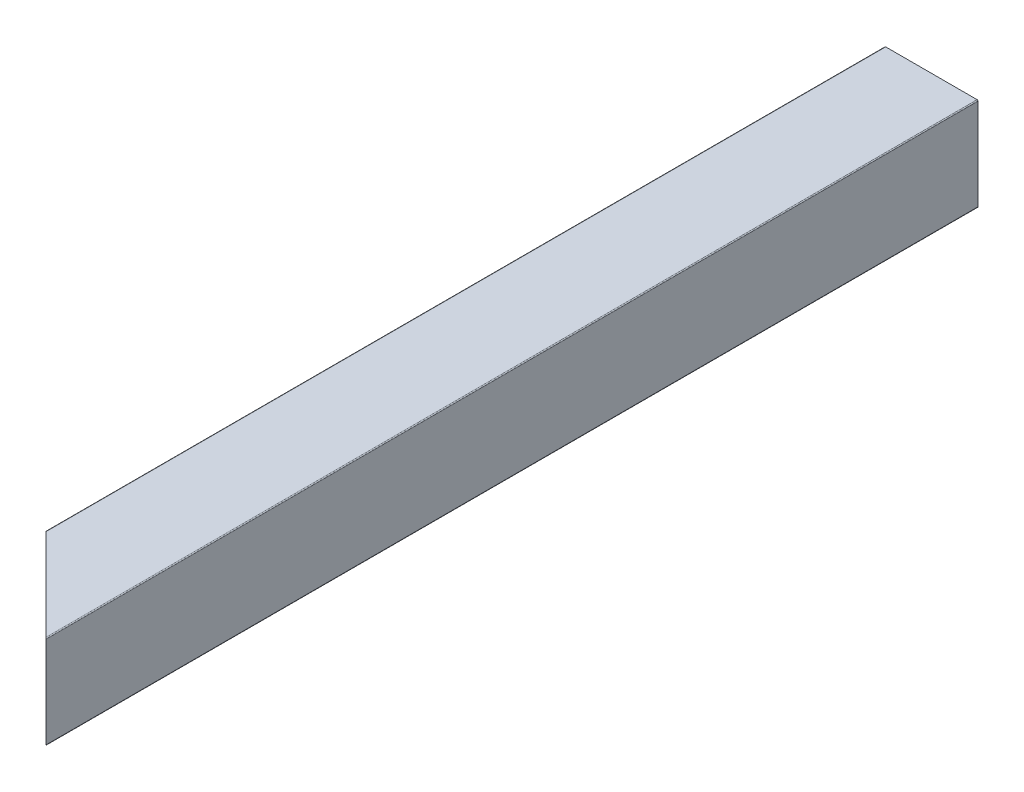
ISO-10303-21;
HEADER;
FILE_DESCRIPTION(('STEP AP214'),'2;1');
FILE_NAME('part.step','',(''),(''),'','','');
FILE_SCHEMA(('AUTOMOTIVE_DESIGN { 1 0 10303 214 1 1 1 1 }'));
ENDSEC;
DATA;
#1=APPLICATION_CONTEXT('core data for automotive mechanical design processes');
#2=APPLICATION_PROTOCOL_DEFINITION('international standard','automotive_design',2000,#1);
#3=PRODUCT_CONTEXT('',#1,'mechanical');
#4=PRODUCT('Part','Part','',(#3));
#5=PRODUCT_RELATED_PRODUCT_CATEGORY('part','',(#4));
#6=PRODUCT_DEFINITION_FORMATION('','',#4);
#7=PRODUCT_DEFINITION_CONTEXT('part definition',#1,'design');
#8=PRODUCT_DEFINITION('design','',#6,#7);
#9=PRODUCT_DEFINITION_SHAPE('','',#8);
#10=(LENGTH_UNIT() NAMED_UNIT(*) SI_UNIT(.MILLI.,.METRE.));
#11=(NAMED_UNIT(*) PLANE_ANGLE_UNIT() SI_UNIT($,.RADIAN.));
#12=(NAMED_UNIT(*) SI_UNIT($,.STERADIAN.) SOLID_ANGLE_UNIT());
#13=UNCERTAINTY_MEASURE_WITH_UNIT(LENGTH_MEASURE(1.E-05),#10,'distance_accuracy_value','');
#14=(GEOMETRIC_REPRESENTATION_CONTEXT(3) GLOBAL_UNCERTAINTY_ASSIGNED_CONTEXT((#13)) GLOBAL_UNIT_ASSIGNED_CONTEXT((#10,
#11,#12)) REPRESENTATION_CONTEXT('',''));
#15=CARTESIAN_POINT('',(0.,0.,0.));
#16=DIRECTION('',(0.,0.,1.));
#17=DIRECTION('',(1.,0.,0.));
#18=AXIS2_PLACEMENT_3D('',#15,#16,#17);
#19=CARTESIAN_POINT('',(3.175,4.7625,1828.8));
#20=DIRECTION('',(1.,0.,0.));
#21=DIRECTION('',(0.,1.,0.));
#22=AXIS2_PLACEMENT_3D('',#19,#20,#21);
#23=PLANE('',#22);
#24=DIRECTION('',(0.,1.,0.));
#25=VECTOR('',#24,1.);
#26=CARTESIAN_POINT('',(3.175,4.7625,1806.575));
#27=LINE('',#26,#25);
#28=CARTESIAN_POINT('',(3.175,4.7625,1806.575));
#29=VERTEX_POINT('',#28);
#30=CARTESIAN_POINT('',(3.175,20.6375,1806.575));
#31=VERTEX_POINT('',#30);
#32=EDGE_CURVE('E301',#29,#31,#27,.T.);
#33=ORIENTED_EDGE('',*,*,#32,.F.);
#34=DIRECTION('',(0.,0.,-1.));
#35=VECTOR('',#34,1.);
#36=CARTESIAN_POINT('',(3.175,4.7625,1828.8));
#37=LINE('',#36,#35);
#38=CARTESIAN_POINT('',(3.175,4.7625,1574.8));
#39=VERTEX_POINT('',#38);
#40=EDGE_CURVE('E68',#29,#39,#37,.T.);
#41=ORIENTED_EDGE('',*,*,#40,.T.);
#42=DIRECTION('',(0.,-1.,0.));
#43=VECTOR('',#42,1.);
#44=CARTESIAN_POINT('',(3.175,4.7625,1574.8));
#45=LINE('',#44,#43);
#46=CARTESIAN_POINT('',(3.175,20.6375,1574.8));
#47=VERTEX_POINT('',#46);
#48=EDGE_CURVE('E207',#47,#39,#45,.T.);
#49=ORIENTED_EDGE('',*,*,#48,.F.);
#50=DIRECTION('',(0.,0.,-1.));
#51=VECTOR('',#50,1.);
#52=CARTESIAN_POINT('',(3.175,20.6375,1828.8));
#53=LINE('',#52,#51);
#54=EDGE_CURVE('E53',#31,#47,#53,.T.);
#55=ORIENTED_EDGE('',*,*,#54,.F.);
#56=EDGE_LOOP('',(#33,#41,#49,#55));
#57=FACE_BOUND('',#56,.T.);
#58=ADVANCED_FACE('F45',(#57),#23,.T.);
#59=CARTESIAN_POINT('',(4.7625,20.6375,1828.8));
#60=DIRECTION('',(0.,0.,-1.));
#61=DIRECTION('',(-1.,0.,0.));
#62=AXIS2_PLACEMENT_3D('',#59,#60,#61);
#63=CYLINDRICAL_SURFACE('',#62,1.5875);
#64=DIRECTION('',(0.,0.,-1.));
#65=VECTOR('',#64,1.);
#66=CARTESIAN_POINT('',(4.7625,22.225,1828.8));
#67=LINE('',#66,#65);
#68=CARTESIAN_POINT('',(4.7625,22.225,1808.1625));
#69=VERTEX_POINT('',#68);
#70=CARTESIAN_POINT('',(4.7625,22.225,1574.8));
#71=VERTEX_POINT('',#70);
#72=EDGE_CURVE('E236',#69,#71,#67,.T.);
#73=ORIENTED_EDGE('',*,*,#72,.F.);
#74=CARTESIAN_POINT('',(4.7625,20.6375,1808.1625));
#75=DIRECTION('',(0.707106781186551,0.,-0.707106781186544));
#76=DIRECTION('',(-0.707106781186544,0.,-0.707106781186551));
#77=AXIS2_PLACEMENT_3D('',#74,#75,#76);
#78=ELLIPSE('',#77,2.2450640302673,1.5875);
#79=EDGE_CURVE('E303',#69,#31,#78,.F.);
#80=ORIENTED_EDGE('',*,*,#79,.T.);
#81=ORIENTED_EDGE('',*,*,#54,.T.);
#82=CARTESIAN_POINT('',(4.7625,20.6375,1574.8));
#83=DIRECTION('',(0.,0.,1.));
#84=DIRECTION('',(1.,0.,0.));
#85=AXIS2_PLACEMENT_3D('',#82,#83,#84);
#86=CIRCLE('',#85,1.5875);
#87=EDGE_CURVE('E214',#47,#71,#86,.F.);
#88=ORIENTED_EDGE('',*,*,#87,.T.);
#89=EDGE_LOOP('',(#73,#80,#81,#88));
#90=FACE_BOUND('',#89,.T.);
#91=ADVANCED_FACE('F360',(#90),#63,.F.);
#92=CARTESIAN_POINT('',(4.7625,22.225,1828.8));
#93=DIRECTION('',(0.,-1.,0.));
#94=DIRECTION('',(0.,0.,-1.));
#95=AXIS2_PLACEMENT_3D('',#92,#93,#94);
#96=PLANE('',#95);
#97=DIRECTION('',(0.707106781186544,0.,0.707106781186551));
#98=VECTOR('',#97,1.);
#99=CARTESIAN_POINT('',(15.0812500000001,22.225,1818.48125));
#100=LINE('',#99,#98);
#101=CARTESIAN_POINT('',(20.6375,22.225,1824.0375));
#102=VERTEX_POINT('',#101);
#103=EDGE_CURVE('E306',#69,#102,#100,.T.);
#104=ORIENTED_EDGE('',*,*,#103,.F.);
#105=ORIENTED_EDGE('',*,*,#72,.T.);
#106=DIRECTION('',(-1.,0.,0.));
#107=VECTOR('',#106,1.);
#108=CARTESIAN_POINT('',(4.7625,22.225,1574.8));
#109=LINE('',#108,#107);
#110=CARTESIAN_POINT('',(20.6375,22.225,1574.8));
#111=VERTEX_POINT('',#110);
#112=EDGE_CURVE('E221',#111,#71,#109,.T.);
#113=ORIENTED_EDGE('',*,*,#112,.F.);
#114=DIRECTION('',(0.,0.,-1.));
#115=VECTOR('',#114,1.);
#116=CARTESIAN_POINT('',(20.6375,22.225,1828.8));
#117=LINE('',#116,#115);
#118=EDGE_CURVE('E233',#102,#111,#117,.T.);
#119=ORIENTED_EDGE('',*,*,#118,.F.);
#120=EDGE_LOOP('',(#104,#105,#113,#119));
#121=FACE_BOUND('',#120,.T.);
#122=ADVANCED_FACE('F366',(#121),#96,.T.);
#123=CARTESIAN_POINT('',(20.6375,20.6375,1828.8));
#124=DIRECTION('',(0.,0.,-1.));
#125=DIRECTION('',(-1.,0.,0.));
#126=AXIS2_PLACEMENT_3D('',#123,#124,#125);
#127=CYLINDRICAL_SURFACE('',#126,1.5875);
#128=DIRECTION('',(0.,0.,-1.));
#129=VECTOR('',#128,1.);
#130=CARTESIAN_POINT('',(22.225,20.6375,1828.8));
#131=LINE('',#130,#129);
#132=CARTESIAN_POINT('',(22.225,20.6375,1825.625));
#133=VERTEX_POINT('',#132);
#134=CARTESIAN_POINT('',(22.225,20.6375,1574.8));
#135=VERTEX_POINT('',#134);
#136=EDGE_CURVE('E237',#133,#135,#131,.T.);
#137=ORIENTED_EDGE('',*,*,#136,.F.);
#138=CARTESIAN_POINT('',(20.6375,20.6375,1824.0375));
#139=DIRECTION('',(0.707106781186551,0.,-0.707106781186544));
#140=DIRECTION('',(-0.707106781186544,0.,-0.707106781186551));
#141=AXIS2_PLACEMENT_3D('',#138,#139,#140);
#142=ELLIPSE('',#141,2.2450640302673,1.5875);
#143=EDGE_CURVE('E308',#133,#102,#142,.F.);
#144=ORIENTED_EDGE('',*,*,#143,.T.);
#145=ORIENTED_EDGE('',*,*,#118,.T.);
#146=CARTESIAN_POINT('',(20.6375,20.6375,1574.8));
#147=DIRECTION('',(0.,0.,1.));
#148=DIRECTION('',(1.,0.,0.));
#149=AXIS2_PLACEMENT_3D('',#146,#147,#148);
#150=CIRCLE('',#149,1.5875);
#151=EDGE_CURVE('E268',#111,#135,#150,.F.);
#152=ORIENTED_EDGE('',*,*,#151,.T.);
#153=EDGE_LOOP('',(#137,#144,#145,#152));
#154=FACE_BOUND('',#153,.T.);
#155=ADVANCED_FACE('F274',(#154),#127,.F.);
#156=CARTESIAN_POINT('',(22.225,4.7625,1828.8));
#157=DIRECTION('',(-1.,0.,0.));
#158=DIRECTION('',(0.,0.,1.));
#159=AXIS2_PLACEMENT_3D('',#156,#157,#158);
#160=PLANE('',#159);
#161=DIRECTION('',(0.,-1.,0.));
#162=VECTOR('',#161,1.);
#163=CARTESIAN_POINT('',(22.225,4.7625,1825.625));
#164=LINE('',#163,#162);
#165=CARTESIAN_POINT('',(22.225,4.7625,1825.625));
#166=VERTEX_POINT('',#165);
#167=EDGE_CURVE('E259',#133,#166,#164,.T.);
#168=ORIENTED_EDGE('',*,*,#167,.F.);
#169=ORIENTED_EDGE('',*,*,#136,.T.);
#170=DIRECTION('',(0.,1.,0.));
#171=VECTOR('',#170,1.);
#172=CARTESIAN_POINT('',(22.225,4.7625,1574.8));
#173=LINE('',#172,#171);
#174=CARTESIAN_POINT('',(22.225,4.7625,1574.8));
#175=VERTEX_POINT('',#174);
#176=EDGE_CURVE('E258',#175,#135,#173,.T.);
#177=ORIENTED_EDGE('',*,*,#176,.F.);
#178=DIRECTION('',(0.,0.,-1.));
#179=VECTOR('',#178,1.);
#180=CARTESIAN_POINT('',(22.225,4.7625,1828.8));
#181=LINE('',#180,#179);
#182=EDGE_CURVE('E204',#166,#175,#181,.T.);
#183=ORIENTED_EDGE('',*,*,#182,.F.);
#184=EDGE_LOOP('',(#168,#169,#177,#183));
#185=FACE_BOUND('',#184,.T.);
#186=ADVANCED_FACE('F256',(#185),#160,.T.);
#187=CARTESIAN_POINT('',(20.6375,4.7625,1828.8));
#188=DIRECTION('',(0.,0.,-1.));
#189=DIRECTION('',(-1.,0.,0.));
#190=AXIS2_PLACEMENT_3D('',#187,#188,#189);
#191=CYLINDRICAL_SURFACE('',#190,1.5875);
#192=DIRECTION('',(0.,0.,-1.));
#193=VECTOR('',#192,1.);
#194=CARTESIAN_POINT('',(20.6375,3.175,1828.8));
#195=LINE('',#194,#193);
#196=CARTESIAN_POINT('',(20.6375,3.175,1824.0375));
#197=VERTEX_POINT('',#196);
#198=CARTESIAN_POINT('',(20.6375,3.175,1574.8));
#199=VERTEX_POINT('',#198);
#200=EDGE_CURVE('E202',#197,#199,#195,.T.);
#201=ORIENTED_EDGE('',*,*,#200,.F.);
#202=CARTESIAN_POINT('',(20.6375,4.7625,1824.0375));
#203=DIRECTION('',(0.707106781186551,0.,-0.707106781186544));
#204=DIRECTION('',(-0.707106781186544,0.,-0.707106781186551));
#205=AXIS2_PLACEMENT_3D('',#202,#203,#204);
#206=ELLIPSE('',#205,2.2450640302673,1.5875);
#207=EDGE_CURVE('E311',#197,#166,#206,.F.);
#208=ORIENTED_EDGE('',*,*,#207,.T.);
#209=ORIENTED_EDGE('',*,*,#182,.T.);
#210=CARTESIAN_POINT('',(20.6375,4.7625,1574.8));
#211=DIRECTION('',(0.,0.,1.));
#212=DIRECTION('',(1.,0.,0.));
#213=AXIS2_PLACEMENT_3D('',#210,#211,#212);
#214=CIRCLE('',#213,1.5875);
#215=EDGE_CURVE('E272',#175,#199,#214,.F.);
#216=ORIENTED_EDGE('',*,*,#215,.T.);
#217=EDGE_LOOP('',(#201,#208,#209,#216));
#218=FACE_BOUND('',#217,.T.);
#219=ADVANCED_FACE('F373',(#218),#191,.F.);
#220=CARTESIAN_POINT('',(4.7625,3.175,1828.8));
#221=DIRECTION('',(0.,1.,0.));
#222=DIRECTION('',(1.,0.,0.));
#223=AXIS2_PLACEMENT_3D('',#220,#221,#222);
#224=PLANE('',#223);
#225=DIRECTION('',(-0.707106781186544,0.,-0.707106781186551));
#226=VECTOR('',#225,1.);
#227=CARTESIAN_POINT('',(15.0812500000001,3.175,1818.48125));
#228=LINE('',#227,#226);
#229=CARTESIAN_POINT('',(4.7625,3.175,1808.1625));
#230=VERTEX_POINT('',#229);
#231=EDGE_CURVE('E60',#197,#230,#228,.T.);
#232=ORIENTED_EDGE('',*,*,#231,.F.);
#233=ORIENTED_EDGE('',*,*,#200,.T.);
#234=DIRECTION('',(1.,0.,0.));
#235=VECTOR('',#234,1.);
#236=CARTESIAN_POINT('',(4.7625,3.175,1574.8));
#237=LINE('',#236,#235);
#238=CARTESIAN_POINT('',(4.7625,3.175,1574.8));
#239=VERTEX_POINT('',#238);
#240=EDGE_CURVE('E279',#239,#199,#237,.T.);
#241=ORIENTED_EDGE('',*,*,#240,.F.);
#242=DIRECTION('',(0.,0.,-1.));
#243=VECTOR('',#242,1.);
#244=CARTESIAN_POINT('',(4.7625,3.175,1828.8));
#245=LINE('',#244,#243);
#246=EDGE_CURVE('E205',#230,#239,#245,.T.);
#247=ORIENTED_EDGE('',*,*,#246,.F.);
#248=EDGE_LOOP('',(#232,#233,#241,#247));
#249=FACE_BOUND('',#248,.T.);
#250=ADVANCED_FACE('F375',(#249),#224,.T.);
#251=CARTESIAN_POINT('',(4.7625,4.7625,1828.8));
#252=DIRECTION('',(0.,0.,-1.));
#253=DIRECTION('',(-1.,0.,0.));
#254=AXIS2_PLACEMENT_3D('',#251,#252,#253);
#255=CYLINDRICAL_SURFACE('',#254,1.5875);
#256=ORIENTED_EDGE('',*,*,#40,.F.);
#257=CARTESIAN_POINT('',(4.7625,4.7625,1808.1625));
#258=DIRECTION('',(0.707106781186551,0.,-0.707106781186544));
#259=DIRECTION('',(-0.707106781186544,0.,-0.707106781186551));
#260=AXIS2_PLACEMENT_3D('',#257,#258,#259);
#261=ELLIPSE('',#260,2.2450640302673,1.5875);
#262=EDGE_CURVE('E172',#29,#230,#261,.F.);
#263=ORIENTED_EDGE('',*,*,#262,.T.);
#264=ORIENTED_EDGE('',*,*,#246,.T.);
#265=CARTESIAN_POINT('',(4.7625,4.7625,1574.8));
#266=DIRECTION('',(0.,0.,1.));
#267=DIRECTION('',(1.,0.,0.));
#268=AXIS2_PLACEMENT_3D('',#265,#266,#267);
#269=CIRCLE('',#268,1.5875);
#270=EDGE_CURVE('E281',#239,#39,#269,.F.);
#271=ORIENTED_EDGE('',*,*,#270,.T.);
#272=EDGE_LOOP('',(#256,#263,#264,#271));
#273=FACE_BOUND('',#272,.T.);
#274=ADVANCED_FACE('F381',(#273),#255,.F.);
#275=CARTESIAN_POINT('',(0.,0.254,1828.8));
#276=DIRECTION('',(1.,0.,0.));
#277=DIRECTION('',(0.,1.,0.));
#278=AXIS2_PLACEMENT_3D('',#275,#276,#277);
#279=PLANE('',#278);
#280=DIRECTION('',(0.,0.,-1.));
#281=VECTOR('',#280,1.);
#282=CARTESIAN_POINT('',(0.,0.254,1828.8));
#283=LINE('',#282,#281);
#284=CARTESIAN_POINT('',(0.,0.254,1803.4));
#285=VERTEX_POINT('',#284);
#286=CARTESIAN_POINT('',(0.,0.254,1574.8));
#287=VERTEX_POINT('',#286);
#288=EDGE_CURVE('E213',#285,#287,#283,.T.);
#289=ORIENTED_EDGE('',*,*,#288,.F.);
#290=DIRECTION('',(0.,1.,0.));
#291=VECTOR('',#290,1.);
#292=CARTESIAN_POINT('',(0.,0.254,1803.4));
#293=LINE('',#292,#291);
#294=CARTESIAN_POINT('',(0.,25.146,1803.4));
#295=VERTEX_POINT('',#294);
#296=EDGE_CURVE('E317',#285,#295,#293,.T.);
#297=ORIENTED_EDGE('',*,*,#296,.T.);
#298=DIRECTION('',(0.,0.,-1.));
#299=VECTOR('',#298,1.);
#300=CARTESIAN_POINT('',(0.,25.146,1828.8));
#301=LINE('',#300,#299);
#302=CARTESIAN_POINT('',(0.,25.146,1574.8));
#303=VERTEX_POINT('',#302);
#304=EDGE_CURVE('E193',#295,#303,#301,.T.);
#305=ORIENTED_EDGE('',*,*,#304,.T.);
#306=DIRECTION('',(0.,-1.,0.));
#307=VECTOR('',#306,1.);
#308=CARTESIAN_POINT('',(0.,0.254,1574.8));
#309=LINE('',#308,#307);
#310=EDGE_CURVE('E293',#303,#287,#309,.T.);
#311=ORIENTED_EDGE('',*,*,#310,.T.);
#312=EDGE_LOOP('',(#289,#297,#305,#311));
#313=FACE_BOUND('',#312,.T.);
#314=ADVANCED_FACE('F339',(#313),#279,.F.);
#315=CARTESIAN_POINT('',(0.254,25.146,1828.8));
#316=DIRECTION('',(0.,0.,-1.));
#317=DIRECTION('',(-1.,0.,0.));
#318=AXIS2_PLACEMENT_3D('',#315,#316,#317);
#319=CYLINDRICAL_SURFACE('',#318,0.254);
#320=CARTESIAN_POINT('',(0.254,25.146,1803.654));
#321=DIRECTION('',(0.707106781186551,0.,-0.707106781186544));
#322=DIRECTION('',(-0.707106781186544,0.,-0.707106781186551));
#323=AXIS2_PLACEMENT_3D('',#320,#321,#322);
#324=ELLIPSE('',#323,0.359210244842768,0.254);
#325=CARTESIAN_POINT('',(0.253999999999997,25.4,1803.654));
#326=VERTEX_POINT('',#325);
#327=EDGE_CURVE('E173',#326,#295,#324,.F.);
#328=ORIENTED_EDGE('',*,*,#327,.F.);
#329=DIRECTION('',(0.,0.,-1.));
#330=VECTOR('',#329,1.);
#331=CARTESIAN_POINT('',(0.254,25.4,1828.8));
#332=LINE('',#331,#330);
#333=CARTESIAN_POINT('',(0.254000000000004,25.4,1574.8));
#334=VERTEX_POINT('',#333);
#335=EDGE_CURVE('E181',#326,#334,#332,.T.);
#336=ORIENTED_EDGE('',*,*,#335,.T.);
#337=CARTESIAN_POINT('',(0.254,25.146,1574.8));
#338=DIRECTION('',(0.,0.,1.));
#339=DIRECTION('',(1.,0.,0.));
#340=AXIS2_PLACEMENT_3D('',#337,#338,#339);
#341=CIRCLE('',#340,0.254);
#342=EDGE_CURVE('E290',#303,#334,#341,.F.);
#343=ORIENTED_EDGE('',*,*,#342,.F.);
#344=ORIENTED_EDGE('',*,*,#304,.F.);
#345=EDGE_LOOP('',(#328,#336,#343,#344));
#346=FACE_BOUND('',#345,.T.);
#347=ADVANCED_FACE('F342',(#346),#319,.T.);
#348=CARTESIAN_POINT('',(0.254,25.4,1828.8));
#349=DIRECTION('',(0.,-1.,0.));
#350=DIRECTION('',(0.,0.,-1.));
#351=AXIS2_PLACEMENT_3D('',#348,#349,#350);
#352=PLANE('',#351);
#353=ORIENTED_EDGE('',*,*,#335,.F.);
#354=DIRECTION('',(-0.707106781186544,0.,-0.707106781186551));
#355=VECTOR('',#354,1.);
#356=CARTESIAN_POINT('',(-15.7518674443784,25.4,1787.64813255562));
#357=LINE('',#356,#355);
#358=CARTESIAN_POINT('',(25.146,25.4,1828.546));
#359=VERTEX_POINT('',#358);
#360=EDGE_CURVE('E164',#359,#326,#357,.T.);
#361=ORIENTED_EDGE('',*,*,#360,.F.);
#362=DIRECTION('',(0.,0.,-1.));
#363=VECTOR('',#362,1.);
#364=CARTESIAN_POINT('',(25.146,25.4,1828.8));
#365=LINE('',#364,#363);
#366=CARTESIAN_POINT('',(25.146,25.4,1574.8));
#367=VERTEX_POINT('',#366);
#368=EDGE_CURVE('E179',#359,#367,#365,.T.);
#369=ORIENTED_EDGE('',*,*,#368,.T.);
#370=DIRECTION('',(1.,0.,0.));
#371=VECTOR('',#370,1.);
#372=CARTESIAN_POINT('',(-135.222379220066,25.4,1574.8));
#373=LINE('',#372,#371);
#374=EDGE_CURVE('E299',#334,#367,#373,.T.);
#375=ORIENTED_EDGE('',*,*,#374,.F.);
#376=EDGE_LOOP('',(#353,#361,#369,#375));
#377=FACE_BOUND('',#376,.T.);
#378=ADVANCED_FACE('F177',(#377),#352,.F.);
#379=CARTESIAN_POINT('',(25.146,25.146,1828.8));
#380=DIRECTION('',(0.,0.,-1.));
#381=DIRECTION('',(-1.,0.,0.));
#382=AXIS2_PLACEMENT_3D('',#379,#380,#381);
#383=CYLINDRICAL_SURFACE('',#382,0.254);
#384=CARTESIAN_POINT('',(25.146,25.146,1828.546));
#385=DIRECTION('',(0.707106781186551,0.,-0.707106781186544));
#386=DIRECTION('',(-0.707106781186544,0.,-0.707106781186551));
#387=AXIS2_PLACEMENT_3D('',#384,#385,#386);
#388=ELLIPSE('',#387,0.359210244842768,0.254);
#389=CARTESIAN_POINT('',(25.4000000000001,25.146,1828.8));
#390=VERTEX_POINT('',#389);
#391=EDGE_CURVE('E161',#390,#359,#388,.F.);
#392=ORIENTED_EDGE('',*,*,#391,.F.);
#393=DIRECTION('',(0.,0.,-1.));
#394=VECTOR('',#393,1.);
#395=CARTESIAN_POINT('',(25.4,25.146,1828.8));
#396=LINE('',#395,#394);
#397=CARTESIAN_POINT('',(25.4,25.146,1574.8));
#398=VERTEX_POINT('',#397);
#399=EDGE_CURVE('E187',#390,#398,#396,.T.);
#400=ORIENTED_EDGE('',*,*,#399,.T.);
#401=CARTESIAN_POINT('',(25.146,25.146,1574.8));
#402=DIRECTION('',(0.,0.,1.));
#403=DIRECTION('',(1.,0.,0.));
#404=AXIS2_PLACEMENT_3D('',#401,#402,#403);
#405=CIRCLE('',#404,0.254);
#406=EDGE_CURVE('E185',#367,#398,#405,.F.);
#407=ORIENTED_EDGE('',*,*,#406,.F.);
#408=ORIENTED_EDGE('',*,*,#368,.F.);
#409=EDGE_LOOP('',(#392,#400,#407,#408));
#410=FACE_BOUND('',#409,.T.);
#411=ADVANCED_FACE('F47',(#410),#383,.T.);
#412=CARTESIAN_POINT('',(25.4,0.254,1828.8));
#413=DIRECTION('',(-1.,0.,0.));
#414=DIRECTION('',(0.,0.,1.));
#415=AXIS2_PLACEMENT_3D('',#412,#413,#414);
#416=PLANE('',#415);
#417=DIRECTION('',(0.,0.,-1.));
#418=VECTOR('',#417,1.);
#419=CARTESIAN_POINT('',(25.4,0.254,1828.8));
#420=LINE('',#419,#418);
#421=CARTESIAN_POINT('',(25.4,0.254,1828.8));
#422=VERTEX_POINT('',#421);
#423=CARTESIAN_POINT('',(25.4,0.254,1574.8));
#424=VERTEX_POINT('',#423);
#425=EDGE_CURVE('E196',#422,#424,#420,.T.);
#426=ORIENTED_EDGE('',*,*,#425,.T.);
#427=DIRECTION('',(0.,1.,0.));
#428=VECTOR('',#427,1.);
#429=CARTESIAN_POINT('',(25.4,0.254,1574.8));
#430=LINE('',#429,#428);
#431=EDGE_CURVE('E284',#424,#398,#430,.T.);
#432=ORIENTED_EDGE('',*,*,#431,.T.);
#433=ORIENTED_EDGE('',*,*,#399,.F.);
#434=DIRECTION('',(0.,1.,0.));
#435=VECTOR('',#434,1.);
#436=CARTESIAN_POINT('',(25.4,0.254,1828.8));
#437=LINE('',#436,#435);
#438=EDGE_CURVE('E167',#422,#390,#437,.T.);
#439=ORIENTED_EDGE('',*,*,#438,.F.);
#440=EDGE_LOOP('',(#426,#432,#433,#439));
#441=FACE_BOUND('',#440,.T.);
#442=ADVANCED_FACE('F345',(#441),#416,.F.);
#443=CARTESIAN_POINT('',(25.146,0.254,1828.8));
#444=DIRECTION('',(0.,0.,-1.));
#445=DIRECTION('',(-1.,0.,0.));
#446=AXIS2_PLACEMENT_3D('',#443,#444,#445);
#447=CYLINDRICAL_SURFACE('',#446,0.254);
#448=CARTESIAN_POINT('',(25.146,0.254,1828.546));
#449=DIRECTION('',(0.707106781186551,0.,-0.707106781186544));
#450=DIRECTION('',(-0.707106781186544,0.,-0.707106781186551));
#451=AXIS2_PLACEMENT_3D('',#448,#449,#450);
#452=ELLIPSE('',#451,0.359210244842768,0.254);
#453=CARTESIAN_POINT('',(25.1460000000001,0.,1828.546));
#454=VERTEX_POINT('',#453);
#455=EDGE_CURVE('E322',#454,#422,#452,.F.);
#456=ORIENTED_EDGE('',*,*,#455,.F.);
#457=DIRECTION('',(0.,0.,-1.));
#458=VECTOR('',#457,1.);
#459=CARTESIAN_POINT('',(25.146,0.,1828.8));
#460=LINE('',#459,#458);
#461=CARTESIAN_POINT('',(25.146,0.,1574.8));
#462=VERTEX_POINT('',#461);
#463=EDGE_CURVE('E227',#454,#462,#460,.T.);
#464=ORIENTED_EDGE('',*,*,#463,.T.);
#465=CARTESIAN_POINT('',(25.146,0.254,1574.8));
#466=DIRECTION('',(0.,0.,1.));
#467=DIRECTION('',(1.,0.,0.));
#468=AXIS2_PLACEMENT_3D('',#465,#466,#467);
#469=CIRCLE('',#468,0.254);
#470=EDGE_CURVE('E287',#424,#462,#469,.F.);
#471=ORIENTED_EDGE('',*,*,#470,.F.);
#472=ORIENTED_EDGE('',*,*,#425,.F.);
#473=EDGE_LOOP('',(#456,#464,#471,#472));
#474=FACE_BOUND('',#473,.T.);
#475=ADVANCED_FACE('F348',(#474),#447,.T.);
#476=CARTESIAN_POINT('',(0.254,0.,1828.8));
#477=DIRECTION('',(0.,1.,0.));
#478=DIRECTION('',(1.,0.,0.));
#479=AXIS2_PLACEMENT_3D('',#476,#477,#478);
#480=PLANE('',#479);
#481=ORIENTED_EDGE('',*,*,#463,.F.);
#482=DIRECTION('',(-0.707106781186544,0.,-0.707106781186551));
#483=VECTOR('',#482,1.);
#484=CARTESIAN_POINT('',(-15.7518674443784,0.,1787.64813255562));
#485=LINE('',#484,#483);
#486=CARTESIAN_POINT('',(0.253999999999999,0.,1803.654));
#487=VERTEX_POINT('',#486);
#488=EDGE_CURVE('E182',#454,#487,#485,.T.);
#489=ORIENTED_EDGE('',*,*,#488,.T.);
#490=DIRECTION('',(0.,0.,-1.));
#491=VECTOR('',#490,1.);
#492=CARTESIAN_POINT('',(0.254,0.,1828.8));
#493=LINE('',#492,#491);
#494=CARTESIAN_POINT('',(0.254,0.,1574.8));
#495=VERTEX_POINT('',#494);
#496=EDGE_CURVE('E199',#487,#495,#493,.T.);
#497=ORIENTED_EDGE('',*,*,#496,.T.);
#498=DIRECTION('',(-1.,0.,0.));
#499=VECTOR('',#498,1.);
#500=CARTESIAN_POINT('',(-135.222379220066,0.,1574.8));
#501=LINE('',#500,#499);
#502=EDGE_CURVE('E296',#462,#495,#501,.T.);
#503=ORIENTED_EDGE('',*,*,#502,.F.);
#504=EDGE_LOOP('',(#481,#489,#497,#503));
#505=FACE_BOUND('',#504,.T.);
#506=ADVANCED_FACE('F328',(#505),#480,.F.);
#507=CARTESIAN_POINT('',(0.254,0.254,1828.8));
#508=DIRECTION('',(0.,0.,-1.));
#509=DIRECTION('',(-1.,0.,0.));
#510=AXIS2_PLACEMENT_3D('',#507,#508,#509);
#511=CYLINDRICAL_SURFACE('',#510,0.254);
#512=CARTESIAN_POINT('',(0.254,0.254,1803.654));
#513=DIRECTION('',(0.707106781186551,0.,-0.707106781186544));
#514=DIRECTION('',(-0.707106781186544,0.,-0.707106781186551));
#515=AXIS2_PLACEMENT_3D('',#512,#513,#514);
#516=ELLIPSE('',#515,0.359210244842768,0.254);
#517=EDGE_CURVE('E320',#285,#487,#516,.F.);
#518=ORIENTED_EDGE('',*,*,#517,.F.);
#519=ORIENTED_EDGE('',*,*,#288,.T.);
#520=CARTESIAN_POINT('',(0.254,0.254,1574.8));
#521=DIRECTION('',(0.,0.,1.));
#522=DIRECTION('',(1.,0.,0.));
#523=AXIS2_PLACEMENT_3D('',#520,#521,#522);
#524=CIRCLE('',#523,0.254);
#525=EDGE_CURVE('E11',#495,#287,#524,.F.);
#526=ORIENTED_EDGE('',*,*,#525,.F.);
#527=ORIENTED_EDGE('',*,*,#496,.F.);
#528=EDGE_LOOP('',(#518,#519,#526,#527));
#529=FACE_BOUND('',#528,.T.);
#530=ADVANCED_FACE('F334',(#529),#511,.T.);
#531=CARTESIAN_POINT('',(-135.222379220066,-1597.83579950754,1574.8));
#532=DIRECTION('',(0.,0.,1.));
#533=DIRECTION('',(1.,0.,0.));
#534=AXIS2_PLACEMENT_3D('',#531,#532,#533);
#535=PLANE('',#534);
#536=ORIENTED_EDGE('',*,*,#48,.T.);
#537=ORIENTED_EDGE('',*,*,#270,.F.);
#538=ORIENTED_EDGE('',*,*,#240,.T.);
#539=ORIENTED_EDGE('',*,*,#215,.F.);
#540=ORIENTED_EDGE('',*,*,#176,.T.);
#541=ORIENTED_EDGE('',*,*,#151,.F.);
#542=ORIENTED_EDGE('',*,*,#112,.T.);
#543=ORIENTED_EDGE('',*,*,#87,.F.);
#544=EDGE_LOOP('',(#536,#537,#538,#539,#540,#541,#542,#543));
#545=FACE_BOUND('',#544,.T.);
#546=ORIENTED_EDGE('',*,*,#406,.T.);
#547=ORIENTED_EDGE('',*,*,#431,.F.);
#548=ORIENTED_EDGE('',*,*,#470,.T.);
#549=ORIENTED_EDGE('',*,*,#502,.T.);
#550=ORIENTED_EDGE('',*,*,#525,.T.);
#551=ORIENTED_EDGE('',*,*,#310,.F.);
#552=ORIENTED_EDGE('',*,*,#342,.T.);
#553=ORIENTED_EDGE('',*,*,#374,.T.);
#554=EDGE_LOOP('',(#546,#547,#548,#549,#550,#551,#552,#553));
#555=FACE_BOUND('',#554,.T.);
#556=ADVANCED_FACE('F265',(#545,#555),#535,.F.);
#557=CARTESIAN_POINT('',(-15.7518674443784,0.,1787.64813255562));
#558=DIRECTION('',(0.707106781186551,0.,-0.707106781186544));
#559=DIRECTION('',(-0.707106781186544,0.,-0.707106781186551));
#560=AXIS2_PLACEMENT_3D('',#557,#558,#559);
#561=PLANE('',#560);
#562=ORIENTED_EDGE('',*,*,#32,.T.);
#563=ORIENTED_EDGE('',*,*,#79,.F.);
#564=ORIENTED_EDGE('',*,*,#103,.T.);
#565=ORIENTED_EDGE('',*,*,#143,.F.);
#566=ORIENTED_EDGE('',*,*,#167,.T.);
#567=ORIENTED_EDGE('',*,*,#207,.F.);
#568=ORIENTED_EDGE('',*,*,#231,.T.);
#569=ORIENTED_EDGE('',*,*,#262,.F.);
#570=EDGE_LOOP('',(#562,#563,#564,#565,#566,#567,#568,#569));
#571=FACE_BOUND('',#570,.T.);
#572=ORIENTED_EDGE('',*,*,#391,.T.);
#573=ORIENTED_EDGE('',*,*,#360,.T.);
#574=ORIENTED_EDGE('',*,*,#327,.T.);
#575=ORIENTED_EDGE('',*,*,#296,.F.);
#576=ORIENTED_EDGE('',*,*,#517,.T.);
#577=ORIENTED_EDGE('',*,*,#488,.F.);
#578=ORIENTED_EDGE('',*,*,#455,.T.);
#579=ORIENTED_EDGE('',*,*,#438,.T.);
#580=EDGE_LOOP('',(#572,#573,#574,#575,#576,#577,#578,#579));
#581=FACE_BOUND('',#580,.T.);
#582=ADVANCED_FACE('F163',(#571,#581),#561,.F.);
#583=CLOSED_SHELL('',(#58,#91,#122,#155,#186,#219,#250,#274,#314,#347,#378,#411,#442,#475,#506,
#530,#556,#582));
#584=MANIFOLD_SOLID_BREP('B2',#583);
#585=ADVANCED_BREP_SHAPE_REPRESENTATION('',(#18,#584),#14);
#586=SHAPE_DEFINITION_REPRESENTATION(#9,#585);
ENDSEC;
END-ISO-10303-21;
